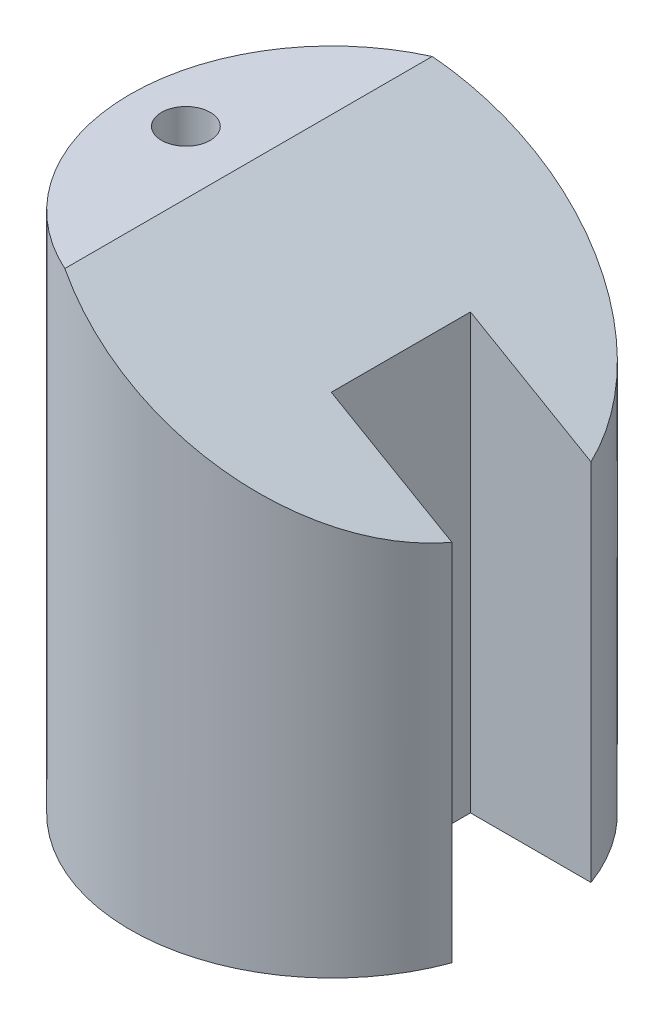
ISO-10303-21;
HEADER;
FILE_DESCRIPTION(('STEP AP214'),'2;1');
FILE_NAME('part.step','',(''),(''),'','','');
FILE_SCHEMA(('AUTOMOTIVE_DESIGN { 1 0 10303 214 1 1 1 1 }'));
ENDSEC;
DATA;
#1=APPLICATION_CONTEXT('core data for automotive mechanical design processes');
#2=APPLICATION_PROTOCOL_DEFINITION('international standard','automotive_design',2000,#1);
#3=PRODUCT_CONTEXT('',#1,'mechanical');
#4=PRODUCT('Part','Part','',(#3));
#5=PRODUCT_RELATED_PRODUCT_CATEGORY('part','',(#4));
#6=PRODUCT_DEFINITION_FORMATION('','',#4);
#7=PRODUCT_DEFINITION_CONTEXT('part definition',#1,'design');
#8=PRODUCT_DEFINITION('design','',#6,#7);
#9=PRODUCT_DEFINITION_SHAPE('','',#8);
#10=(LENGTH_UNIT() NAMED_UNIT(*) SI_UNIT(.MILLI.,.METRE.));
#11=(NAMED_UNIT(*) PLANE_ANGLE_UNIT() SI_UNIT($,.RADIAN.));
#12=(NAMED_UNIT(*) SI_UNIT($,.STERADIAN.) SOLID_ANGLE_UNIT());
#13=UNCERTAINTY_MEASURE_WITH_UNIT(LENGTH_MEASURE(1.E-05),#10,'distance_accuracy_value','');
#14=(GEOMETRIC_REPRESENTATION_CONTEXT(3) GLOBAL_UNCERTAINTY_ASSIGNED_CONTEXT((#13)) GLOBAL_UNIT_ASSIGNED_CONTEXT((#10,
#11,#12)) REPRESENTATION_CONTEXT('',''));
#15=CARTESIAN_POINT('',(0.,0.,0.));
#16=DIRECTION('',(0.,0.,1.));
#17=DIRECTION('',(1.,0.,0.));
#18=AXIS2_PLACEMENT_3D('',#15,#16,#17);
#19=CARTESIAN_POINT('',(0.,75.,0.));
#20=DIRECTION('',(0.,-1.,0.));
#21=DIRECTION('',(0.,0.,-1.));
#22=AXIS2_PLACEMENT_3D('',#19,#20,#21);
#23=CYLINDRICAL_SURFACE('',#22,29.);
#24=CARTESIAN_POINT('',(0.,68.0717967697245,0.));
#25=DIRECTION('',(0.500000000000001,0.866025403784438,0.));
#26=DIRECTION('',(0.866025403784438,-0.500000000000001,0.));
#27=AXIS2_PLACEMENT_3D('',#24,#25,#26);
#28=ELLIPSE('',#27,33.4863156129983,29.);
#29=CARTESIAN_POINT('',(27.2213151776324,52.3555631242227,-10.));
#30=VERTEX_POINT('',#29);
#31=CARTESIAN_POINT('',(-12.,75.,-26.4007575648882));
#32=VERTEX_POINT('',#31);
#33=EDGE_CURVE('E76',#30,#32,#28,.T.);
#34=ORIENTED_EDGE('',*,*,#33,.F.);
#35=DIRECTION('',(0.,1.,0.));
#36=VECTOR('',#35,1.);
#37=CARTESIAN_POINT('',(27.2213151776324,-10.,-10.));
#38=LINE('',#37,#36);
#39=CARTESIAN_POINT('',(27.2213151776324,0.,-10.));
#40=VERTEX_POINT('',#39);
#41=EDGE_CURVE('E137',#40,#30,#38,.T.);
#42=ORIENTED_EDGE('',*,*,#41,.F.);
#43=CARTESIAN_POINT('',(0.,0.,0.));
#44=DIRECTION('',(0.,1.,0.));
#45=DIRECTION('',(0.,0.,1.));
#46=AXIS2_PLACEMENT_3D('',#43,#44,#45);
#47=CIRCLE('',#46,29.);
#48=CARTESIAN_POINT('',(27.2213151776324,0.,10.));
#49=VERTEX_POINT('',#48);
#50=EDGE_CURVE('E153',#40,#49,#47,.T.);
#51=ORIENTED_EDGE('',*,*,#50,.T.);
#52=DIRECTION('',(0.,1.,0.));
#53=VECTOR('',#52,1.);
#54=CARTESIAN_POINT('',(27.2213151776324,-10.,10.));
#55=LINE('',#54,#53);
#56=CARTESIAN_POINT('',(27.2213151776324,52.3555631242227,10.));
#57=VERTEX_POINT('',#56);
#58=EDGE_CURVE('E106',#49,#57,#55,.T.);
#59=ORIENTED_EDGE('',*,*,#58,.T.);
#60=CARTESIAN_POINT('',(-12.,75.,26.4007575648882));
#61=VERTEX_POINT('',#60);
#62=EDGE_CURVE('E144',#61,#57,#28,.T.);
#63=ORIENTED_EDGE('',*,*,#62,.F.);
#64=CARTESIAN_POINT('',(0.,75.,0.));
#65=DIRECTION('',(0.,1.,0.));
#66=DIRECTION('',(0.,0.,1.));
#67=AXIS2_PLACEMENT_3D('',#64,#65,#66);
#68=CIRCLE('',#67,29.);
#69=EDGE_CURVE('E61',#32,#61,#68,.T.);
#70=ORIENTED_EDGE('',*,*,#69,.F.);
#71=EDGE_LOOP('',(#34,#42,#51,#59,#63,#70));
#72=FACE_BOUND('',#71,.T.);
#73=ADVANCED_FACE('F53',(#72),#23,.T.);
#74=CARTESIAN_POINT('',(0.,75.,0.));
#75=DIRECTION('',(0.,1.,0.));
#76=DIRECTION('',(0.,0.,1.));
#77=AXIS2_PLACEMENT_3D('',#74,#75,#76);
#78=PLANE('',#77);
#79=CARTESIAN_POINT('',(-21.,75.,0.));
#80=DIRECTION('',(0.,1.,0.));
#81=DIRECTION('',(0.,0.,1.));
#82=AXIS2_PLACEMENT_3D('',#79,#80,#81);
#83=CIRCLE('',#82,3.5);
#84=CARTESIAN_POINT('',(-21.,75.,3.5));
#85=VERTEX_POINT('',#84);
#86=EDGE_CURVE('E148',#85,#85,#83,.T.);
#87=ORIENTED_EDGE('',*,*,#86,.F.);
#88=EDGE_LOOP('',(#87));
#89=FACE_BOUND('',#88,.T.);
#90=ORIENTED_EDGE('',*,*,#69,.T.);
#91=DIRECTION('',(0.,0.,-1.));
#92=VECTOR('',#91,1.);
#93=CARTESIAN_POINT('',(-12.,75.,0.));
#94=LINE('',#93,#92);
#95=EDGE_CURVE('E13',#61,#32,#94,.T.);
#96=ORIENTED_EDGE('',*,*,#95,.T.);
#97=EDGE_LOOP('',(#90,#96));
#98=FACE_BOUND('',#97,.T.);
#99=ADVANCED_FACE('F168',(#89,#98),#78,.T.);
#100=CARTESIAN_POINT('',(0.,0.,0.));
#101=DIRECTION('',(0.,1.,0.));
#102=DIRECTION('',(0.,0.,1.));
#103=AXIS2_PLACEMENT_3D('',#100,#101,#102);
#104=PLANE('',#103);
#105=ORIENTED_EDGE('',*,*,#50,.F.);
#106=DIRECTION('',(-1.,0.,0.));
#107=VECTOR('',#106,1.);
#108=CARTESIAN_POINT('',(0.,0.,-9.99999999999998));
#109=LINE('',#108,#107);
#110=CARTESIAN_POINT('',(9.90080710194367,0.,-9.99999999999999));
#111=VERTEX_POINT('',#110);
#112=EDGE_CURVE('E112',#40,#111,#109,.T.);
#113=ORIENTED_EDGE('',*,*,#112,.T.);
#114=DIRECTION('',(0.,0.,1.));
#115=VECTOR('',#114,1.);
#116=CARTESIAN_POINT('',(9.90080710194367,0.,-9.99999999999999));
#117=LINE('',#116,#115);
#118=CARTESIAN_POINT('',(9.90080710194367,0.,10.));
#119=VERTEX_POINT('',#118);
#120=EDGE_CURVE('E117',#111,#119,#117,.T.);
#121=ORIENTED_EDGE('',*,*,#120,.T.);
#122=DIRECTION('',(1.,0.,0.));
#123=VECTOR('',#122,1.);
#124=CARTESIAN_POINT('',(0.,0.,10.));
#125=LINE('',#124,#123);
#126=EDGE_CURVE('E101',#119,#49,#125,.T.);
#127=ORIENTED_EDGE('',*,*,#126,.T.);
#128=EDGE_LOOP('',(#105,#113,#121,#127));
#129=FACE_BOUND('',#128,.T.);
#130=ADVANCED_FACE('F121',(#129),#104,.F.);
#131=CARTESIAN_POINT('',(-21.,25.,0.));
#132=DIRECTION('',(0.,1.,0.));
#133=DIRECTION('',(0.,0.,1.));
#134=AXIS2_PLACEMENT_3D('',#131,#132,#133);
#135=CYLINDRICAL_SURFACE('',#134,3.5);
#136=CARTESIAN_POINT('',(-21.,25.,0.));
#137=DIRECTION('',(0.,1.,0.));
#138=DIRECTION('',(0.,0.,1.));
#139=AXIS2_PLACEMENT_3D('',#136,#137,#138);
#140=CIRCLE('',#139,3.5);
#141=CARTESIAN_POINT('',(-21.,25.,3.5));
#142=VERTEX_POINT('',#141);
#143=EDGE_CURVE('E149',#142,#142,#140,.T.);
#144=ORIENTED_EDGE('',*,*,#143,.F.);
#145=EDGE_LOOP('',(#144));
#146=FACE_BOUND('',#145,.T.);
#147=ORIENTED_EDGE('',*,*,#86,.T.);
#148=EDGE_LOOP('',(#147));
#149=FACE_BOUND('',#148,.T.);
#150=ADVANCED_FACE('F176',(#146,#149),#135,.F.);
#151=CARTESIAN_POINT('',(-21.,25.,0.));
#152=DIRECTION('',(0.,1.,0.));
#153=DIRECTION('',(0.,0.,1.));
#154=AXIS2_PLACEMENT_3D('',#151,#152,#153);
#155=PLANE('',#154);
#156=ORIENTED_EDGE('',*,*,#143,.T.);
#157=EDGE_LOOP('',(#156));
#158=FACE_BOUND('',#157,.T.);
#159=ADVANCED_FACE('F181',(#158),#155,.T.);
#160=CARTESIAN_POINT('',(-12.,75.,29.));
#161=DIRECTION('',(0.500000000000001,0.866025403784438,0.));
#162=DIRECTION('',(-0.866025403784438,0.500000000000001,0.));
#163=AXIS2_PLACEMENT_3D('',#160,#161,#162);
#164=PLANE('',#163);
#165=DIRECTION('',(-0.866025403784438,0.500000000000001,0.));
#166=VECTOR('',#165,1.);
#167=CARTESIAN_POINT('',(27.2213151776324,52.3555631242227,-10.));
#168=LINE('',#167,#166);
#169=CARTESIAN_POINT('',(9.90080710194367,62.3555631242228,-9.99999999999999));
#170=VERTEX_POINT('',#169);
#171=EDGE_CURVE('E123',#30,#170,#168,.T.);
#172=ORIENTED_EDGE('',*,*,#171,.F.);
#173=ORIENTED_EDGE('',*,*,#33,.T.);
#174=ORIENTED_EDGE('',*,*,#95,.F.);
#175=ORIENTED_EDGE('',*,*,#62,.T.);
#176=DIRECTION('',(0.866025403784438,-0.500000000000001,0.));
#177=VECTOR('',#176,1.);
#178=CARTESIAN_POINT('',(27.2213151776324,52.3555631242227,10.));
#179=LINE('',#178,#177);
#180=CARTESIAN_POINT('',(9.90080710194367,62.3555631242227,10.));
#181=VERTEX_POINT('',#180);
#182=EDGE_CURVE('E128',#181,#57,#179,.T.);
#183=ORIENTED_EDGE('',*,*,#182,.F.);
#184=DIRECTION('',(0.,0.,1.));
#185=VECTOR('',#184,1.);
#186=CARTESIAN_POINT('',(9.90080710194367,62.3555631242228,-9.99999999999999));
#187=LINE('',#186,#185);
#188=EDGE_CURVE('E68',#170,#181,#187,.T.);
#189=ORIENTED_EDGE('',*,*,#188,.F.);
#190=EDGE_LOOP('',(#172,#173,#174,#175,#183,#189));
#191=FACE_BOUND('',#190,.T.);
#192=ADVANCED_FACE('F166',(#191),#164,.T.);
#193=CARTESIAN_POINT('',(27.2213151776324,-10.,-10.));
#194=DIRECTION('',(0.,0.,-1.));
#195=DIRECTION('',(-1.,0.,0.));
#196=AXIS2_PLACEMENT_3D('',#193,#194,#195);
#197=PLANE('',#196);
#198=ORIENTED_EDGE('',*,*,#41,.T.);
#199=ORIENTED_EDGE('',*,*,#171,.T.);
#200=DIRECTION('',(0.,1.,0.));
#201=VECTOR('',#200,1.);
#202=CARTESIAN_POINT('',(9.90080710194367,0.,-9.99999999999999));
#203=LINE('',#202,#201);
#204=EDGE_CURVE('E113',#111,#170,#203,.T.);
#205=ORIENTED_EDGE('',*,*,#204,.F.);
#206=ORIENTED_EDGE('',*,*,#112,.F.);
#207=EDGE_LOOP('',(#198,#199,#205,#206));
#208=FACE_BOUND('',#207,.T.);
#209=ADVANCED_FACE('F165',(#208),#197,.F.);
#210=CARTESIAN_POINT('',(27.2213151776324,-10.,10.));
#211=DIRECTION('',(0.,0.,1.));
#212=DIRECTION('',(1.,0.,0.));
#213=AXIS2_PLACEMENT_3D('',#210,#211,#212);
#214=PLANE('',#213);
#215=DIRECTION('',(0.,1.,0.));
#216=VECTOR('',#215,1.);
#217=CARTESIAN_POINT('',(9.90080710194367,0.,10.));
#218=LINE('',#217,#216);
#219=EDGE_CURVE('E103',#119,#181,#218,.T.);
#220=ORIENTED_EDGE('',*,*,#219,.T.);
#221=ORIENTED_EDGE('',*,*,#182,.T.);
#222=ORIENTED_EDGE('',*,*,#58,.F.);
#223=ORIENTED_EDGE('',*,*,#126,.F.);
#224=EDGE_LOOP('',(#220,#221,#222,#223));
#225=FACE_BOUND('',#224,.T.);
#226=ADVANCED_FACE('F102',(#225),#214,.F.);
#227=CARTESIAN_POINT('',(9.90080710194367,0.,-9.99999999999999));
#228=DIRECTION('',(-1.,0.,0.));
#229=DIRECTION('',(0.,0.,1.));
#230=AXIS2_PLACEMENT_3D('',#227,#228,#229);
#231=PLANE('',#230);
#232=ORIENTED_EDGE('',*,*,#188,.T.);
#233=ORIENTED_EDGE('',*,*,#219,.F.);
#234=ORIENTED_EDGE('',*,*,#120,.F.);
#235=ORIENTED_EDGE('',*,*,#204,.T.);
#236=EDGE_LOOP('',(#232,#233,#234,#235));
#237=FACE_BOUND('',#236,.T.);
#238=ADVANCED_FACE('F116',(#237),#231,.F.);
#239=CLOSED_SHELL('',(#73,#99,#130,#150,#159,#192,#209,#226,#238));
#240=MANIFOLD_SOLID_BREP('B2',#239);
#241=ADVANCED_BREP_SHAPE_REPRESENTATION('',(#18,#240),#14);
#242=SHAPE_DEFINITION_REPRESENTATION(#9,#241);
ENDSEC;
END-ISO-10303-21;
